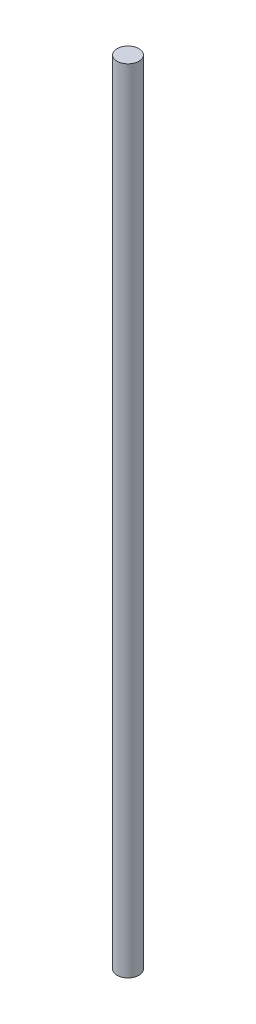
ISO-10303-21;
HEADER;
FILE_DESCRIPTION(('STEP AP214'),'2;1');
FILE_NAME('part.step','',(''),(''),'','','');
FILE_SCHEMA(('AUTOMOTIVE_DESIGN { 1 0 10303 214 1 1 1 1 }'));
ENDSEC;
DATA;
#1=APPLICATION_CONTEXT('core data for automotive mechanical design processes');
#2=APPLICATION_PROTOCOL_DEFINITION('international standard','automotive_design',2000,#1);
#3=PRODUCT_CONTEXT('',#1,'mechanical');
#4=PRODUCT('Part','Part','',(#3));
#5=PRODUCT_RELATED_PRODUCT_CATEGORY('part','',(#4));
#6=PRODUCT_DEFINITION_FORMATION('','',#4);
#7=PRODUCT_DEFINITION_CONTEXT('part definition',#1,'design');
#8=PRODUCT_DEFINITION('design','',#6,#7);
#9=PRODUCT_DEFINITION_SHAPE('','',#8);
#10=(LENGTH_UNIT() NAMED_UNIT(*) SI_UNIT(.MILLI.,.METRE.));
#11=(NAMED_UNIT(*) PLANE_ANGLE_UNIT() SI_UNIT($,.RADIAN.));
#12=(NAMED_UNIT(*) SI_UNIT($,.STERADIAN.) SOLID_ANGLE_UNIT());
#13=UNCERTAINTY_MEASURE_WITH_UNIT(LENGTH_MEASURE(1.E-05),#10,'distance_accuracy_value','');
#14=(GEOMETRIC_REPRESENTATION_CONTEXT(3) GLOBAL_UNCERTAINTY_ASSIGNED_CONTEXT((#13)) GLOBAL_UNIT_ASSIGNED_CONTEXT((#10,
#11,#12)) REPRESENTATION_CONTEXT('',''));
#15=CARTESIAN_POINT('',(0.,0.,0.));
#16=DIRECTION('',(0.,0.,1.));
#17=DIRECTION('',(1.,0.,0.));
#18=AXIS2_PLACEMENT_3D('',#15,#16,#17);
#19=CARTESIAN_POINT('',(0.,230.,0.));
#20=DIRECTION('',(0.,-1.,0.));
#21=DIRECTION('',(0.,0.,-1.));
#22=AXIS2_PLACEMENT_3D('',#19,#20,#21);
#23=CYLINDRICAL_SURFACE('',#22,3.175);
#24=CARTESIAN_POINT('',(0.,230.,0.));
#25=DIRECTION('',(0.,1.,0.));
#26=DIRECTION('',(0.,0.,1.));
#27=AXIS2_PLACEMENT_3D('',#24,#25,#26);
#28=CIRCLE('',#27,3.175);
#29=CARTESIAN_POINT('',(0.,230.,3.175));
#30=VERTEX_POINT('',#29);
#31=EDGE_CURVE('E10',#30,#30,#28,.T.);
#32=ORIENTED_EDGE('',*,*,#31,.F.);
#33=EDGE_LOOP('',(#32));
#34=FACE_BOUND('',#33,.T.);
#35=CARTESIAN_POINT('',(0.,0.,0.));
#36=DIRECTION('',(0.,1.,0.));
#37=DIRECTION('',(0.,0.,1.));
#38=AXIS2_PLACEMENT_3D('',#35,#36,#37);
#39=CIRCLE('',#38,3.175);
#40=CARTESIAN_POINT('',(0.,0.,3.175));
#41=VERTEX_POINT('',#40);
#42=EDGE_CURVE('E34',#41,#41,#39,.T.);
#43=ORIENTED_EDGE('',*,*,#42,.T.);
#44=EDGE_LOOP('',(#43));
#45=FACE_BOUND('',#44,.T.);
#46=ADVANCED_FACE('F31',(#34,#45),#23,.T.);
#47=CARTESIAN_POINT('',(0.,230.,0.));
#48=DIRECTION('',(0.,1.,0.));
#49=DIRECTION('',(0.,0.,1.));
#50=AXIS2_PLACEMENT_3D('',#47,#48,#49);
#51=PLANE('',#50);
#52=ORIENTED_EDGE('',*,*,#31,.T.);
#53=EDGE_LOOP('',(#52));
#54=FACE_BOUND('',#53,.T.);
#55=ADVANCED_FACE('F46',(#54),#51,.T.);
#56=CARTESIAN_POINT('',(0.,0.,0.));
#57=DIRECTION('',(0.,1.,0.));
#58=DIRECTION('',(0.,0.,1.));
#59=AXIS2_PLACEMENT_3D('',#56,#57,#58);
#60=PLANE('',#59);
#61=ORIENTED_EDGE('',*,*,#42,.F.);
#62=EDGE_LOOP('',(#61));
#63=FACE_BOUND('',#62,.T.);
#64=ADVANCED_FACE('F44',(#63),#60,.F.);
#65=CLOSED_SHELL('',(#46,#55,#64));
#66=MANIFOLD_SOLID_BREP('B2',#65);
#67=ADVANCED_BREP_SHAPE_REPRESENTATION('',(#18,#66),#14);
#68=SHAPE_DEFINITION_REPRESENTATION(#9,#67);
ENDSEC;
END-ISO-10303-21;
